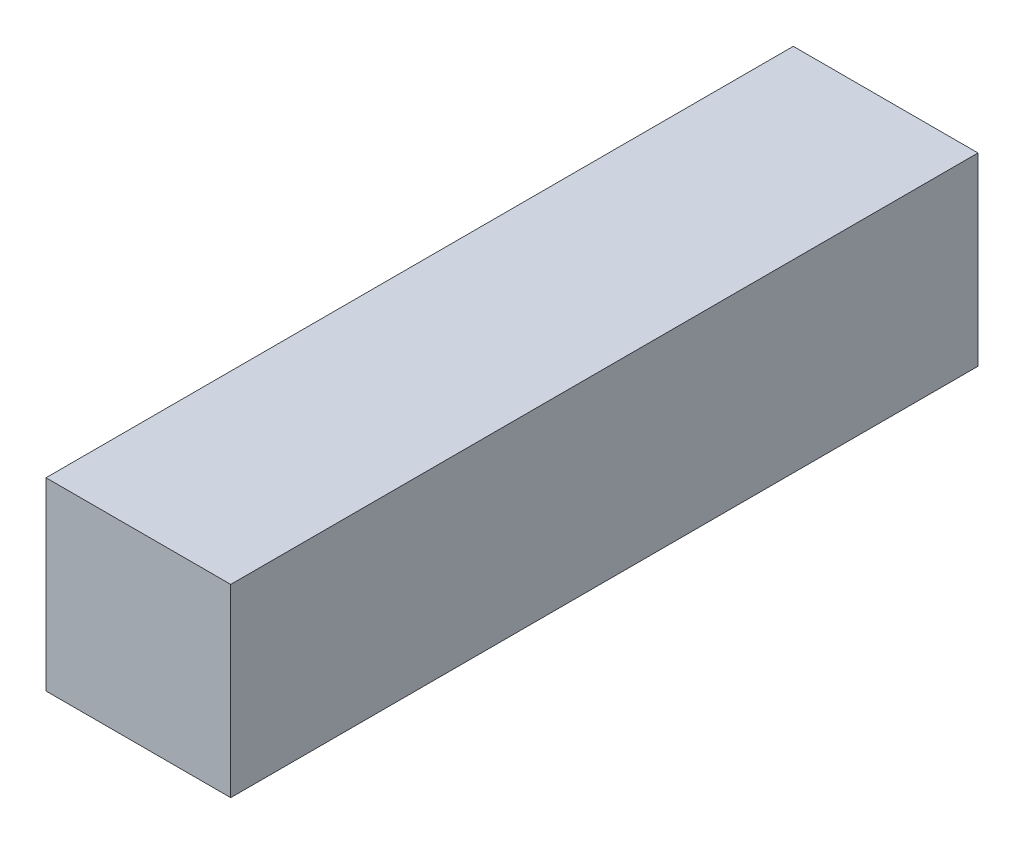
ISO-10303-21;
HEADER;
FILE_DESCRIPTION(('STEP AP214'),'2;1');
FILE_NAME('part.step','',(''),(''),'','','');
FILE_SCHEMA(('AUTOMOTIVE_DESIGN { 1 0 10303 214 1 1 1 1 }'));
ENDSEC;
DATA;
#1=APPLICATION_CONTEXT('core data for automotive mechanical design processes');
#2=APPLICATION_PROTOCOL_DEFINITION('international standard','automotive_design',2000,#1);
#3=PRODUCT_CONTEXT('',#1,'mechanical');
#4=PRODUCT('Part','Part','',(#3));
#5=PRODUCT_RELATED_PRODUCT_CATEGORY('part','',(#4));
#6=PRODUCT_DEFINITION_FORMATION('','',#4);
#7=PRODUCT_DEFINITION_CONTEXT('part definition',#1,'design');
#8=PRODUCT_DEFINITION('design','',#6,#7);
#9=PRODUCT_DEFINITION_SHAPE('','',#8);
#10=(LENGTH_UNIT() NAMED_UNIT(*) SI_UNIT(.MILLI.,.METRE.));
#11=(NAMED_UNIT(*) PLANE_ANGLE_UNIT() SI_UNIT($,.RADIAN.));
#12=(NAMED_UNIT(*) SI_UNIT($,.STERADIAN.) SOLID_ANGLE_UNIT());
#13=UNCERTAINTY_MEASURE_WITH_UNIT(LENGTH_MEASURE(1.E-05),#10,'distance_accuracy_value','');
#14=(GEOMETRIC_REPRESENTATION_CONTEXT(3) GLOBAL_UNCERTAINTY_ASSIGNED_CONTEXT((#13)) GLOBAL_UNIT_ASSIGNED_CONTEXT((#10,
#11,#12)) REPRESENTATION_CONTEXT('',''));
#15=CARTESIAN_POINT('',(0.,0.,0.));
#16=DIRECTION('',(0.,0.,1.));
#17=DIRECTION('',(1.,0.,0.));
#18=AXIS2_PLACEMENT_3D('',#15,#16,#17);
#19=CARTESIAN_POINT('',(0.,0.,-89.));
#20=DIRECTION('',(-1.,0.,0.));
#21=DIRECTION('',(0.,0.,1.));
#22=AXIS2_PLACEMENT_3D('',#19,#20,#21);
#23=PLANE('',#22);
#24=DIRECTION('',(0.,-1.,0.));
#25=VECTOR('',#24,1.);
#26=CARTESIAN_POINT('',(0.,0.,0.));
#27=LINE('',#26,#25);
#28=CARTESIAN_POINT('',(0.,22.,0.));
#29=VERTEX_POINT('',#28);
#30=CARTESIAN_POINT('',(0.,0.,0.));
#31=VERTEX_POINT('',#30);
#32=EDGE_CURVE('E95',#29,#31,#27,.T.);
#33=ORIENTED_EDGE('',*,*,#32,.F.);
#34=DIRECTION('',(0.,0.,1.));
#35=VECTOR('',#34,1.);
#36=CARTESIAN_POINT('',(0.,22.,-89.));
#37=LINE('',#36,#35);
#38=CARTESIAN_POINT('',(0.,22.,-89.));
#39=VERTEX_POINT('',#38);
#40=EDGE_CURVE('E11',#39,#29,#37,.T.);
#41=ORIENTED_EDGE('',*,*,#40,.F.);
#42=DIRECTION('',(0.,-1.,0.));
#43=VECTOR('',#42,1.);
#44=CARTESIAN_POINT('',(0.,0.,-89.));
#45=LINE('',#44,#43);
#46=CARTESIAN_POINT('',(0.,0.,-89.));
#47=VERTEX_POINT('',#46);
#48=EDGE_CURVE('E89',#39,#47,#45,.T.);
#49=ORIENTED_EDGE('',*,*,#48,.T.);
#50=DIRECTION('',(0.,0.,1.));
#51=VECTOR('',#50,1.);
#52=CARTESIAN_POINT('',(0.,0.,-89.));
#53=LINE('',#52,#51);
#54=EDGE_CURVE('E34',#47,#31,#53,.T.);
#55=ORIENTED_EDGE('',*,*,#54,.T.);
#56=EDGE_LOOP('',(#33,#41,#49,#55));
#57=FACE_BOUND('',#56,.T.);
#58=ADVANCED_FACE('F31',(#57),#23,.T.);
#59=CARTESIAN_POINT('',(0.,22.,-89.));
#60=DIRECTION('',(0.,1.,0.));
#61=DIRECTION('',(0.,0.,1.));
#62=AXIS2_PLACEMENT_3D('',#59,#60,#61);
#63=PLANE('',#62);
#64=DIRECTION('',(-1.,0.,0.));
#65=VECTOR('',#64,1.);
#66=CARTESIAN_POINT('',(0.,22.,0.));
#67=LINE('',#66,#65);
#68=CARTESIAN_POINT('',(22.,22.,0.));
#69=VERTEX_POINT('',#68);
#70=EDGE_CURVE('E91',#69,#29,#67,.T.);
#71=ORIENTED_EDGE('',*,*,#70,.F.);
#72=DIRECTION('',(0.,0.,1.));
#73=VECTOR('',#72,1.);
#74=CARTESIAN_POINT('',(22.,22.,-89.));
#75=LINE('',#74,#73);
#76=CARTESIAN_POINT('',(22.,22.,-89.));
#77=VERTEX_POINT('',#76);
#78=EDGE_CURVE('E40',#77,#69,#75,.T.);
#79=ORIENTED_EDGE('',*,*,#78,.F.);
#80=DIRECTION('',(-1.,0.,0.));
#81=VECTOR('',#80,1.);
#82=CARTESIAN_POINT('',(0.,22.,-89.));
#83=LINE('',#82,#81);
#84=EDGE_CURVE('E86',#77,#39,#83,.T.);
#85=ORIENTED_EDGE('',*,*,#84,.T.);
#86=ORIENTED_EDGE('',*,*,#40,.T.);
#87=EDGE_LOOP('',(#71,#79,#85,#86));
#88=FACE_BOUND('',#87,.T.);
#89=ADVANCED_FACE('F105',(#88),#63,.T.);
#90=CARTESIAN_POINT('',(22.,0.,-89.));
#91=DIRECTION('',(1.,0.,0.));
#92=DIRECTION('',(0.,0.,-1.));
#93=AXIS2_PLACEMENT_3D('',#90,#91,#92);
#94=PLANE('',#93);
#95=DIRECTION('',(0.,1.,0.));
#96=VECTOR('',#95,1.);
#97=CARTESIAN_POINT('',(22.,0.,0.));
#98=LINE('',#97,#96);
#99=CARTESIAN_POINT('',(22.,0.,0.));
#100=VERTEX_POINT('',#99);
#101=EDGE_CURVE('E81',#100,#69,#98,.T.);
#102=ORIENTED_EDGE('',*,*,#101,.F.);
#103=DIRECTION('',(0.,0.,1.));
#104=VECTOR('',#103,1.);
#105=CARTESIAN_POINT('',(22.,0.,-89.));
#106=LINE('',#105,#104);
#107=CARTESIAN_POINT('',(22.,0.,-89.));
#108=VERTEX_POINT('',#107);
#109=EDGE_CURVE('E76',#108,#100,#106,.T.);
#110=ORIENTED_EDGE('',*,*,#109,.F.);
#111=DIRECTION('',(0.,1.,0.));
#112=VECTOR('',#111,1.);
#113=CARTESIAN_POINT('',(22.,0.,-89.));
#114=LINE('',#113,#112);
#115=EDGE_CURVE('E79',#108,#77,#114,.T.);
#116=ORIENTED_EDGE('',*,*,#115,.T.);
#117=ORIENTED_EDGE('',*,*,#78,.T.);
#118=EDGE_LOOP('',(#102,#110,#116,#117));
#119=FACE_BOUND('',#118,.T.);
#120=ADVANCED_FACE('F78',(#119),#94,.T.);
#121=CARTESIAN_POINT('',(0.,0.,-89.));
#122=DIRECTION('',(0.,-1.,0.));
#123=DIRECTION('',(0.,0.,-1.));
#124=AXIS2_PLACEMENT_3D('',#121,#122,#123);
#125=PLANE('',#124);
#126=DIRECTION('',(1.,0.,0.));
#127=VECTOR('',#126,1.);
#128=CARTESIAN_POINT('',(0.,0.,0.));
#129=LINE('',#128,#127);
#130=EDGE_CURVE('E98',#31,#100,#129,.T.);
#131=ORIENTED_EDGE('',*,*,#130,.F.);
#132=ORIENTED_EDGE('',*,*,#54,.F.);
#133=DIRECTION('',(1.,0.,0.));
#134=VECTOR('',#133,1.);
#135=CARTESIAN_POINT('',(0.,0.,-89.));
#136=LINE('',#135,#134);
#137=EDGE_CURVE('E85',#47,#108,#136,.T.);
#138=ORIENTED_EDGE('',*,*,#137,.T.);
#139=ORIENTED_EDGE('',*,*,#109,.T.);
#140=EDGE_LOOP('',(#131,#132,#138,#139));
#141=FACE_BOUND('',#140,.T.);
#142=ADVANCED_FACE('F88',(#141),#125,.T.);
#143=CARTESIAN_POINT('',(0.,22.,-89.));
#144=DIRECTION('',(0.,0.,-1.));
#145=DIRECTION('',(-1.,0.,0.));
#146=AXIS2_PLACEMENT_3D('',#143,#144,#145);
#147=PLANE('',#146);
#148=ORIENTED_EDGE('',*,*,#48,.F.);
#149=ORIENTED_EDGE('',*,*,#84,.F.);
#150=ORIENTED_EDGE('',*,*,#115,.F.);
#151=ORIENTED_EDGE('',*,*,#137,.F.);
#152=EDGE_LOOP('',(#148,#149,#150,#151));
#153=FACE_BOUND('',#152,.T.);
#154=ADVANCED_FACE('F84',(#153),#147,.T.);
#155=CARTESIAN_POINT('',(0.,22.,0.));
#156=DIRECTION('',(0.,0.,-1.));
#157=DIRECTION('',(-1.,0.,0.));
#158=AXIS2_PLACEMENT_3D('',#155,#156,#157);
#159=PLANE('',#158);
#160=ORIENTED_EDGE('',*,*,#32,.T.);
#161=ORIENTED_EDGE('',*,*,#130,.T.);
#162=ORIENTED_EDGE('',*,*,#101,.T.);
#163=ORIENTED_EDGE('',*,*,#70,.T.);
#164=EDGE_LOOP('',(#160,#161,#162,#163));
#165=FACE_BOUND('',#164,.T.);
#166=ADVANCED_FACE('F104',(#165),#159,.F.);
#167=CLOSED_SHELL('',(#58,#89,#120,#142,#154,#166));
#168=MANIFOLD_SOLID_BREP('B2',#167);
#169=ADVANCED_BREP_SHAPE_REPRESENTATION('',(#18,#168),#14);
#170=SHAPE_DEFINITION_REPRESENTATION(#9,#169);
ENDSEC;
END-ISO-10303-21;
